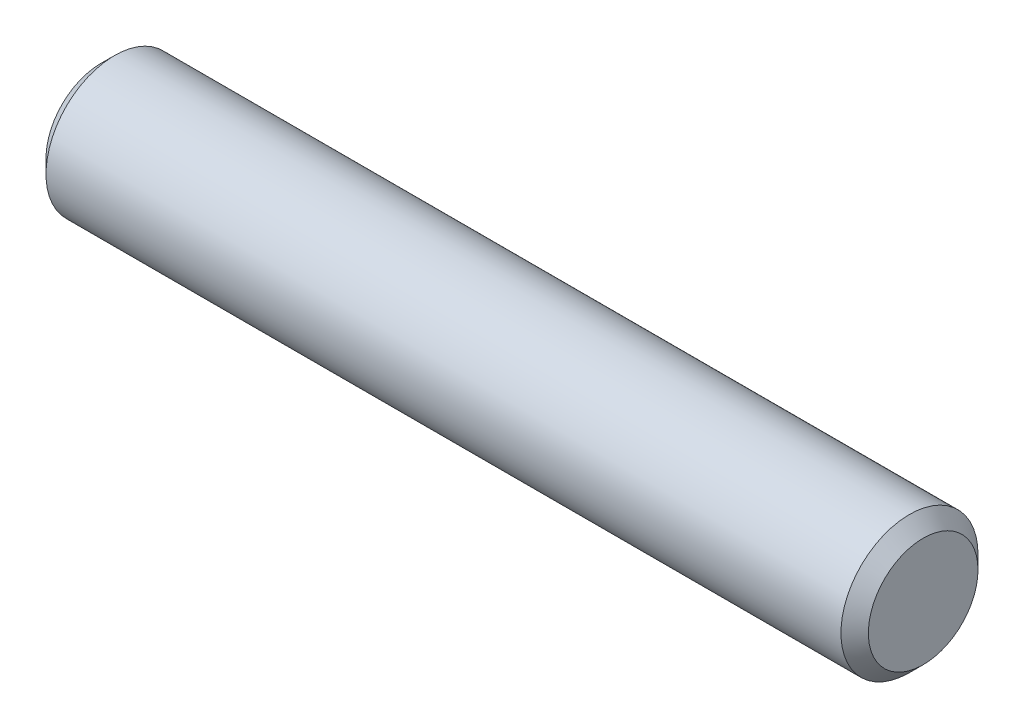
ISO-10303-21;
HEADER;
FILE_DESCRIPTION(('STEP AP214'),'2;1');
FILE_NAME('part.step','',(''),(''),'','','');
FILE_SCHEMA(('AUTOMOTIVE_DESIGN { 1 0 10303 214 1 1 1 1 }'));
ENDSEC;
DATA;
#1=APPLICATION_CONTEXT('core data for automotive mechanical design processes');
#2=APPLICATION_PROTOCOL_DEFINITION('international standard','automotive_design',2000,#1);
#3=PRODUCT_CONTEXT('',#1,'mechanical');
#4=PRODUCT('Part','Part','',(#3));
#5=PRODUCT_RELATED_PRODUCT_CATEGORY('part','',(#4));
#6=PRODUCT_DEFINITION_FORMATION('','',#4);
#7=PRODUCT_DEFINITION_CONTEXT('part definition',#1,'design');
#8=PRODUCT_DEFINITION('design','',#6,#7);
#9=PRODUCT_DEFINITION_SHAPE('','',#8);
#10=(LENGTH_UNIT() NAMED_UNIT(*) SI_UNIT(.MILLI.,.METRE.));
#11=(NAMED_UNIT(*) PLANE_ANGLE_UNIT() SI_UNIT($,.RADIAN.));
#12=(NAMED_UNIT(*) SI_UNIT($,.STERADIAN.) SOLID_ANGLE_UNIT());
#13=UNCERTAINTY_MEASURE_WITH_UNIT(LENGTH_MEASURE(1.E-05),#10,'distance_accuracy_value','');
#14=(GEOMETRIC_REPRESENTATION_CONTEXT(3) GLOBAL_UNCERTAINTY_ASSIGNED_CONTEXT((#13)) GLOBAL_UNIT_ASSIGNED_CONTEXT((#10,
#11,#12)) REPRESENTATION_CONTEXT('',''));
#15=CARTESIAN_POINT('',(0.,0.,0.));
#16=DIRECTION('',(0.,0.,1.));
#17=DIRECTION('',(1.,0.,0.));
#18=AXIS2_PLACEMENT_3D('',#15,#16,#17);
#19=CARTESIAN_POINT('',(-9.525,0.,0.));
#20=DIRECTION('',(1.,0.,0.));
#21=DIRECTION('',(0.,0.,-1.));
#22=AXIS2_PLACEMENT_3D('',#19,#20,#21);
#23=CYLINDRICAL_SURFACE('',#22,1.5875);
#24=CARTESIAN_POINT('',(9.2075,0.,0.));
#25=DIRECTION('',(1.,0.,0.));
#26=DIRECTION('',(0.,0.,-1.));
#27=AXIS2_PLACEMENT_3D('',#24,#25,#26);
#28=CIRCLE('',#27,1.5875);
#29=CARTESIAN_POINT('',(9.2075,0.,-1.5875));
#30=VERTEX_POINT('',#29);
#31=EDGE_CURVE('E40',#30,#30,#28,.F.);
#32=ORIENTED_EDGE('',*,*,#31,.T.);
#33=EDGE_LOOP('',(#32));
#34=FACE_BOUND('',#33,.T.);
#35=CARTESIAN_POINT('',(-9.2075,0.,0.));
#36=DIRECTION('',(1.,0.,0.));
#37=DIRECTION('',(0.,0.,-1.));
#38=AXIS2_PLACEMENT_3D('',#35,#36,#37);
#39=CIRCLE('',#38,1.5875);
#40=CARTESIAN_POINT('',(-9.2075,0.,-1.5875));
#41=VERTEX_POINT('',#40);
#42=EDGE_CURVE('E44',#41,#41,#39,.T.);
#43=ORIENTED_EDGE('',*,*,#42,.T.);
#44=EDGE_LOOP('',(#43));
#45=FACE_BOUND('',#44,.T.);
#46=ADVANCED_FACE('F33',(#34,#45),#23,.T.);
#47=CARTESIAN_POINT('',(-9.525,0.,0.));
#48=DIRECTION('',(1.,0.,0.));
#49=DIRECTION('',(0.,0.,-1.));
#50=AXIS2_PLACEMENT_3D('',#47,#48,#49);
#51=PLANE('',#50);
#52=CARTESIAN_POINT('',(-9.525,0.,0.));
#53=DIRECTION('',(1.,0.,0.));
#54=DIRECTION('',(0.,0.,-1.));
#55=AXIS2_PLACEMENT_3D('',#52,#53,#54);
#56=CIRCLE('',#55,1.27);
#57=CARTESIAN_POINT('',(-9.525,0.,-1.27));
#58=VERTEX_POINT('',#57);
#59=EDGE_CURVE('E10',#58,#58,#56,.F.);
#60=ORIENTED_EDGE('',*,*,#59,.T.);
#61=EDGE_LOOP('',(#60));
#62=FACE_BOUND('',#61,.T.);
#63=ADVANCED_FACE('F64',(#62),#51,.F.);
#64=CARTESIAN_POINT('',(9.525,0.,0.));
#65=DIRECTION('',(1.,0.,0.));
#66=DIRECTION('',(0.,0.,-1.));
#67=AXIS2_PLACEMENT_3D('',#64,#65,#66);
#68=PLANE('',#67);
#69=CARTESIAN_POINT('',(9.525,0.,0.));
#70=DIRECTION('',(1.,0.,0.));
#71=DIRECTION('',(0.,0.,-1.));
#72=AXIS2_PLACEMENT_3D('',#69,#70,#71);
#73=CIRCLE('',#72,1.27);
#74=CARTESIAN_POINT('',(9.525,0.,-1.27));
#75=VERTEX_POINT('',#74);
#76=EDGE_CURVE('E48',#75,#75,#73,.T.);
#77=ORIENTED_EDGE('',*,*,#76,.T.);
#78=EDGE_LOOP('',(#77));
#79=FACE_BOUND('',#78,.T.);
#80=ADVANCED_FACE('F54',(#79),#68,.T.);
#81=CARTESIAN_POINT('',(9.525,0.,0.));
#82=DIRECTION('',(-1.,0.,0.));
#83=DIRECTION('',(0.,0.,1.));
#84=AXIS2_PLACEMENT_3D('',#81,#82,#83);
#85=CONICAL_SURFACE('',#84,1.27,0.785398163397448);
#86=ORIENTED_EDGE('',*,*,#31,.F.);
#87=EDGE_LOOP('',(#86));
#88=FACE_BOUND('',#87,.T.);
#89=ORIENTED_EDGE('',*,*,#76,.F.);
#90=EDGE_LOOP('',(#89));
#91=FACE_BOUND('',#90,.T.);
#92=ADVANCED_FACE('F56',(#88,#91),#85,.T.);
#93=CARTESIAN_POINT('',(-9.2075,0.,0.));
#94=DIRECTION('',(1.,0.,0.));
#95=DIRECTION('',(0.,0.,-1.));
#96=AXIS2_PLACEMENT_3D('',#93,#94,#95);
#97=CONICAL_SURFACE('',#96,1.5875,0.785398163397453);
#98=ORIENTED_EDGE('',*,*,#59,.F.);
#99=EDGE_LOOP('',(#98));
#100=FACE_BOUND('',#99,.T.);
#101=ORIENTED_EDGE('',*,*,#42,.F.);
#102=EDGE_LOOP('',(#101));
#103=FACE_BOUND('',#102,.T.);
#104=ADVANCED_FACE('F35',(#100,#103),#97,.T.);
#105=CLOSED_SHELL('',(#46,#63,#80,#92,#104));
#106=MANIFOLD_SOLID_BREP('B2',#105);
#107=ADVANCED_BREP_SHAPE_REPRESENTATION('',(#18,#106),#14);
#108=SHAPE_DEFINITION_REPRESENTATION(#9,#107);
ENDSEC;
END-ISO-10303-21;
